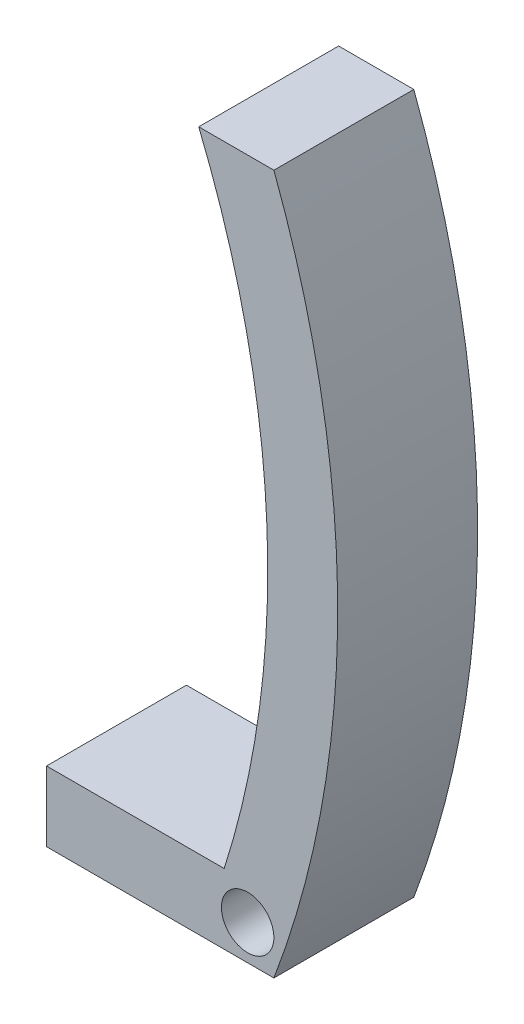
ISO-10303-21;
HEADER;
FILE_DESCRIPTION(('STEP AP214'),'2;1');
FILE_NAME('part.step','',(''),(''),'','','');
FILE_SCHEMA(('AUTOMOTIVE_DESIGN { 1 0 10303 214 1 1 1 1 }'));
ENDSEC;
DATA;
#1=APPLICATION_CONTEXT('core data for automotive mechanical design processes');
#2=APPLICATION_PROTOCOL_DEFINITION('international standard','automotive_design',2000,#1);
#3=PRODUCT_CONTEXT('',#1,'mechanical');
#4=PRODUCT('Part','Part','',(#3));
#5=PRODUCT_RELATED_PRODUCT_CATEGORY('part','',(#4));
#6=PRODUCT_DEFINITION_FORMATION('','',#4);
#7=PRODUCT_DEFINITION_CONTEXT('part definition',#1,'design');
#8=PRODUCT_DEFINITION('design','',#6,#7);
#9=PRODUCT_DEFINITION_SHAPE('','',#8);
#10=(LENGTH_UNIT() NAMED_UNIT(*) SI_UNIT(.MILLI.,.METRE.));
#11=(NAMED_UNIT(*) PLANE_ANGLE_UNIT() SI_UNIT($,.RADIAN.));
#12=(NAMED_UNIT(*) SI_UNIT($,.STERADIAN.) SOLID_ANGLE_UNIT());
#13=UNCERTAINTY_MEASURE_WITH_UNIT(LENGTH_MEASURE(1.E-05),#10,'distance_accuracy_value','');
#14=(GEOMETRIC_REPRESENTATION_CONTEXT(3) GLOBAL_UNCERTAINTY_ASSIGNED_CONTEXT((#13)) GLOBAL_UNIT_ASSIGNED_CONTEXT((#10,
#11,#12)) REPRESENTATION_CONTEXT('',''));
#15=CARTESIAN_POINT('',(0.,0.,0.));
#16=DIRECTION('',(0.,0.,1.));
#17=DIRECTION('',(1.,0.,0.));
#18=AXIS2_PLACEMENT_3D('',#15,#16,#17);
#19=CARTESIAN_POINT('',(0.,0.,10.16));
#20=DIRECTION('',(1.,0.,0.));
#21=DIRECTION('',(0.,0.,-1.));
#22=AXIS2_PLACEMENT_3D('',#19,#20,#21);
#23=PLANE('',#22);
#24=DIRECTION('',(0.,-1.,0.));
#25=VECTOR('',#24,1.);
#26=CARTESIAN_POINT('',(0.,0.,0.));
#27=LINE('',#26,#25);
#28=CARTESIAN_POINT('',(0.,5.08,0.));
#29=VERTEX_POINT('',#28);
#30=CARTESIAN_POINT('',(0.,0.,0.));
#31=VERTEX_POINT('',#30);
#32=EDGE_CURVE('E122',#29,#31,#27,.T.);
#33=ORIENTED_EDGE('',*,*,#32,.T.);
#34=DIRECTION('',(0.,0.,-1.));
#35=VECTOR('',#34,1.);
#36=CARTESIAN_POINT('',(0.,0.,10.16));
#37=LINE('',#36,#35);
#38=CARTESIAN_POINT('',(0.,0.,10.16));
#39=VERTEX_POINT('',#38);
#40=EDGE_CURVE('E11',#39,#31,#37,.T.);
#41=ORIENTED_EDGE('',*,*,#40,.F.);
#42=DIRECTION('',(0.,-1.,0.));
#43=VECTOR('',#42,1.);
#44=CARTESIAN_POINT('',(0.,0.,10.16));
#45=LINE('',#44,#43);
#46=CARTESIAN_POINT('',(0.,5.08,10.16));
#47=VERTEX_POINT('',#46);
#48=EDGE_CURVE('E133',#47,#39,#45,.T.);
#49=ORIENTED_EDGE('',*,*,#48,.F.);
#50=DIRECTION('',(0.,0.,-1.));
#51=VECTOR('',#50,1.);
#52=CARTESIAN_POINT('',(0.,5.08,10.16));
#53=LINE('',#52,#51);
#54=EDGE_CURVE('E118',#47,#29,#53,.T.);
#55=ORIENTED_EDGE('',*,*,#54,.T.);
#56=EDGE_LOOP('',(#33,#41,#49,#55));
#57=FACE_BOUND('',#56,.T.);
#58=ADVANCED_FACE('F38',(#57),#23,.F.);
#59=CARTESIAN_POINT('',(0.,0.,10.16));
#60=DIRECTION('',(0.,1.,0.));
#61=DIRECTION('',(0.,0.,1.));
#62=AXIS2_PLACEMENT_3D('',#59,#60,#61);
#63=PLANE('',#62);
#64=DIRECTION('',(1.,0.,0.));
#65=VECTOR('',#64,1.);
#66=CARTESIAN_POINT('',(0.,0.,0.));
#67=LINE('',#66,#65);
#68=CARTESIAN_POINT('',(16.51,0.,0.));
#69=VERTEX_POINT('',#68);
#70=EDGE_CURVE('E125',#31,#69,#67,.T.);
#71=ORIENTED_EDGE('',*,*,#70,.T.);
#72=DIRECTION('',(0.,0.,-1.));
#73=VECTOR('',#72,1.);
#74=CARTESIAN_POINT('',(16.51,0.,10.16));
#75=LINE('',#74,#73);
#76=CARTESIAN_POINT('',(16.51,0.,10.16));
#77=VERTEX_POINT('',#76);
#78=EDGE_CURVE('E46',#77,#69,#75,.T.);
#79=ORIENTED_EDGE('',*,*,#78,.F.);
#80=DIRECTION('',(1.,0.,0.));
#81=VECTOR('',#80,1.);
#82=CARTESIAN_POINT('',(0.,0.,10.16));
#83=LINE('',#82,#81);
#84=EDGE_CURVE('E91',#39,#77,#83,.T.);
#85=ORIENTED_EDGE('',*,*,#84,.F.);
#86=ORIENTED_EDGE('',*,*,#40,.T.);
#87=EDGE_LOOP('',(#71,#79,#85,#86));
#88=FACE_BOUND('',#87,.T.);
#89=ADVANCED_FACE('F158',(#88),#63,.F.);
#90=CARTESIAN_POINT('',(-50.8,25.4,10.16));
#91=DIRECTION('',(0.,0.,-1.));
#92=DIRECTION('',(-1.,0.,0.));
#93=AXIS2_PLACEMENT_3D('',#90,#91,#92);
#94=CYLINDRICAL_SURFACE('',#93,71.9430059144042);
#95=CARTESIAN_POINT('',(-50.8,25.4,0.));
#96=DIRECTION('',(0.,0.,1.));
#97=DIRECTION('',(1.,0.,0.));
#98=AXIS2_PLACEMENT_3D('',#95,#96,#97);
#99=CIRCLE('',#98,71.9430059144042);
#100=CARTESIAN_POINT('',(16.51,50.8,0.));
#101=VERTEX_POINT('',#100);
#102=EDGE_CURVE('E128',#69,#101,#99,.T.);
#103=ORIENTED_EDGE('',*,*,#102,.T.);
#104=DIRECTION('',(0.,0.,-1.));
#105=VECTOR('',#104,1.);
#106=CARTESIAN_POINT('',(16.51,50.8,10.16));
#107=LINE('',#106,#105);
#108=CARTESIAN_POINT('',(16.51,50.8,10.16));
#109=VERTEX_POINT('',#108);
#110=EDGE_CURVE('E113',#109,#101,#107,.T.);
#111=ORIENTED_EDGE('',*,*,#110,.F.);
#112=CARTESIAN_POINT('',(-50.8,25.4,10.16));
#113=DIRECTION('',(0.,0.,1.));
#114=DIRECTION('',(1.,0.,0.));
#115=AXIS2_PLACEMENT_3D('',#112,#113,#114);
#116=CIRCLE('',#115,71.9430059144042);
#117=EDGE_CURVE('E104',#77,#109,#116,.T.);
#118=ORIENTED_EDGE('',*,*,#117,.F.);
#119=ORIENTED_EDGE('',*,*,#78,.T.);
#120=EDGE_LOOP('',(#103,#111,#118,#119));
#121=FACE_BOUND('',#120,.T.);
#122=ADVANCED_FACE('F139',(#121),#94,.T.);
#123=CARTESIAN_POINT('',(16.51,50.8,10.16));
#124=DIRECTION('',(0.,-1.,0.));
#125=DIRECTION('',(0.,0.,-1.));
#126=AXIS2_PLACEMENT_3D('',#123,#124,#125);
#127=PLANE('',#126);
#128=DIRECTION('',(-1.,0.,0.));
#129=VECTOR('',#128,1.);
#130=CARTESIAN_POINT('',(16.51,50.8,0.));
#131=LINE('',#130,#129);
#132=CARTESIAN_POINT('',(11.0506391228874,50.8,0.));
#133=VERTEX_POINT('',#132);
#134=EDGE_CURVE('E112',#101,#133,#131,.T.);
#135=ORIENTED_EDGE('',*,*,#134,.T.);
#136=DIRECTION('',(0.,0.,-1.));
#137=VECTOR('',#136,1.);
#138=CARTESIAN_POINT('',(11.0506391228874,50.8,10.16));
#139=LINE('',#138,#137);
#140=CARTESIAN_POINT('',(11.0506391228874,50.8,10.16));
#141=VERTEX_POINT('',#140);
#142=EDGE_CURVE('E109',#141,#133,#139,.T.);
#143=ORIENTED_EDGE('',*,*,#142,.F.);
#144=DIRECTION('',(-1.,0.,0.));
#145=VECTOR('',#144,1.);
#146=CARTESIAN_POINT('',(16.51,50.8,10.16));
#147=LINE('',#146,#145);
#148=EDGE_CURVE('E98',#109,#141,#147,.T.);
#149=ORIENTED_EDGE('',*,*,#148,.F.);
#150=ORIENTED_EDGE('',*,*,#110,.T.);
#151=EDGE_LOOP('',(#135,#143,#149,#150));
#152=FACE_BOUND('',#151,.T.);
#153=ADVANCED_FACE('F110',(#152),#127,.F.);
#154=CARTESIAN_POINT('',(-50.8,25.4,10.16));
#155=DIRECTION('',(0.,0.,-1.));
#156=DIRECTION('',(-1.,0.,0.));
#157=AXIS2_PLACEMENT_3D('',#154,#155,#156);
#158=CYLINDRICAL_SURFACE('',#157,66.8630059144042);
#159=CARTESIAN_POINT('',(-50.8,25.4,0.));
#160=DIRECTION('',(0.,0.,-1.));
#161=DIRECTION('',(1.,0.,0.));
#162=AXIS2_PLACEMENT_3D('',#159,#160,#161);
#163=CIRCLE('',#162,66.8630059144042);
#164=CARTESIAN_POINT('',(12.9005428541206,5.08000000000001,0.));
#165=VERTEX_POINT('',#164);
#166=EDGE_CURVE('E77',#133,#165,#163,.T.);
#167=ORIENTED_EDGE('',*,*,#166,.T.);
#168=DIRECTION('',(0.,0.,-1.));
#169=VECTOR('',#168,1.);
#170=CARTESIAN_POINT('',(12.9005428541206,5.08000000000001,10.16));
#171=LINE('',#170,#169);
#172=CARTESIAN_POINT('',(12.9005428541206,5.08000000000001,10.16));
#173=VERTEX_POINT('',#172);
#174=EDGE_CURVE('E114',#173,#165,#171,.T.);
#175=ORIENTED_EDGE('',*,*,#174,.F.);
#176=CARTESIAN_POINT('',(-50.8,25.4,10.16));
#177=DIRECTION('',(0.,0.,-1.));
#178=DIRECTION('',(1.,0.,0.));
#179=AXIS2_PLACEMENT_3D('',#176,#177,#178);
#180=CIRCLE('',#179,66.8630059144042);
#181=EDGE_CURVE('E102',#141,#173,#180,.T.);
#182=ORIENTED_EDGE('',*,*,#181,.F.);
#183=ORIENTED_EDGE('',*,*,#142,.T.);
#184=EDGE_LOOP('',(#167,#175,#182,#183));
#185=FACE_BOUND('',#184,.T.);
#186=ADVANCED_FACE('F116',(#185),#158,.F.);
#187=CARTESIAN_POINT('',(0.,5.08,10.16));
#188=DIRECTION('',(0.,-1.,0.));
#189=DIRECTION('',(1.,0.,0.));
#190=AXIS2_PLACEMENT_3D('',#187,#188,#189);
#191=PLANE('',#190);
#192=DIRECTION('',(-1.,0.,0.));
#193=VECTOR('',#192,1.);
#194=CARTESIAN_POINT('',(0.,5.08,0.));
#195=LINE('',#194,#193);
#196=EDGE_CURVE('E83',#165,#29,#195,.T.);
#197=ORIENTED_EDGE('',*,*,#196,.T.);
#198=ORIENTED_EDGE('',*,*,#54,.F.);
#199=DIRECTION('',(-1.,0.,0.));
#200=VECTOR('',#199,1.);
#201=CARTESIAN_POINT('',(0.,5.08,10.16));
#202=LINE('',#201,#200);
#203=EDGE_CURVE('E54',#173,#47,#202,.T.);
#204=ORIENTED_EDGE('',*,*,#203,.F.);
#205=ORIENTED_EDGE('',*,*,#174,.T.);
#206=EDGE_LOOP('',(#197,#198,#204,#205));
#207=FACE_BOUND('',#206,.T.);
#208=ADVANCED_FACE('F146',(#207),#191,.F.);
#209=CARTESIAN_POINT('',(-50.8,25.4,10.16));
#210=DIRECTION('',(0.,0.,1.));
#211=DIRECTION('',(1.,0.,0.));
#212=AXIS2_PLACEMENT_3D('',#209,#210,#211);
#213=PLANE('',#212);
#214=CARTESIAN_POINT('',(14.605,2.54,10.16));
#215=DIRECTION('',(0.,0.,1.));
#216=DIRECTION('',(1.,0.,0.));
#217=AXIS2_PLACEMENT_3D('',#214,#215,#216);
#218=CIRCLE('',#217,1.905);
#219=CARTESIAN_POINT('',(16.51,2.54,10.16));
#220=VERTEX_POINT('',#219);
#221=EDGE_CURVE('E126',#220,#220,#218,.T.);
#222=ORIENTED_EDGE('',*,*,#221,.F.);
#223=EDGE_LOOP('',(#222));
#224=FACE_BOUND('',#223,.T.);
#225=ORIENTED_EDGE('',*,*,#48,.T.);
#226=ORIENTED_EDGE('',*,*,#84,.T.);
#227=ORIENTED_EDGE('',*,*,#117,.T.);
#228=ORIENTED_EDGE('',*,*,#148,.T.);
#229=ORIENTED_EDGE('',*,*,#181,.T.);
#230=ORIENTED_EDGE('',*,*,#203,.T.);
#231=EDGE_LOOP('',(#225,#226,#227,#228,#229,#230));
#232=FACE_BOUND('',#231,.T.);
#233=ADVANCED_FACE('F100',(#224,#232),#213,.T.);
#234=CARTESIAN_POINT('',(-50.8,25.4,0.));
#235=DIRECTION('',(0.,0.,1.));
#236=DIRECTION('',(1.,0.,0.));
#237=AXIS2_PLACEMENT_3D('',#234,#235,#236);
#238=PLANE('',#237);
#239=CARTESIAN_POINT('',(14.605,2.54,0.));
#240=DIRECTION('',(0.,0.,1.));
#241=DIRECTION('',(1.,0.,0.));
#242=AXIS2_PLACEMENT_3D('',#239,#240,#241);
#243=CIRCLE('',#242,1.905);
#244=CARTESIAN_POINT('',(16.51,2.54,0.));
#245=VERTEX_POINT('',#244);
#246=EDGE_CURVE('E213',#245,#245,#243,.T.);
#247=ORIENTED_EDGE('',*,*,#246,.T.);
#248=EDGE_LOOP('',(#247));
#249=FACE_BOUND('',#248,.T.);
#250=ORIENTED_EDGE('',*,*,#32,.F.);
#251=ORIENTED_EDGE('',*,*,#196,.F.);
#252=ORIENTED_EDGE('',*,*,#166,.F.);
#253=ORIENTED_EDGE('',*,*,#134,.F.);
#254=ORIENTED_EDGE('',*,*,#102,.F.);
#255=ORIENTED_EDGE('',*,*,#70,.F.);
#256=EDGE_LOOP('',(#250,#251,#252,#253,#254,#255));
#257=FACE_BOUND('',#256,.T.);
#258=ADVANCED_FACE('F142',(#249,#257),#238,.F.);
#259=CARTESIAN_POINT('',(14.605,2.54,0.));
#260=DIRECTION('',(0.,0.,1.));
#261=DIRECTION('',(1.,0.,0.));
#262=AXIS2_PLACEMENT_3D('',#259,#260,#261);
#263=CYLINDRICAL_SURFACE('',#262,1.905);
#264=ORIENTED_EDGE('',*,*,#221,.T.);
#265=EDGE_LOOP('',(#264));
#266=FACE_BOUND('',#265,.T.);
#267=ORIENTED_EDGE('',*,*,#246,.F.);
#268=EDGE_LOOP('',(#267));
#269=FACE_BOUND('',#268,.T.);
#270=ADVANCED_FACE('F195',(#266,#269),#263,.F.);
#271=CLOSED_SHELL('',(#58,#89,#122,#153,#186,#208,#233,#258,#270));
#272=MANIFOLD_SOLID_BREP('B2',#271);
#273=ADVANCED_BREP_SHAPE_REPRESENTATION('',(#18,#272),#14);
#274=SHAPE_DEFINITION_REPRESENTATION(#9,#273);
ENDSEC;
END-ISO-10303-21;
